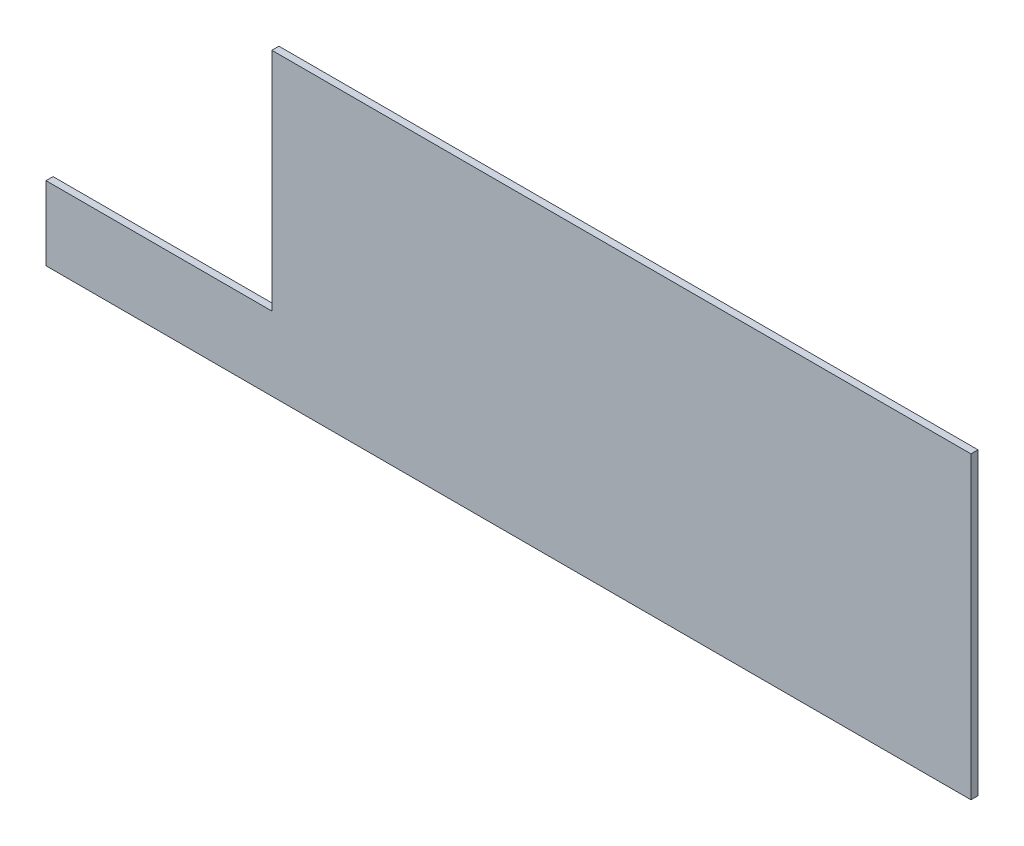
ISO-10303-21;
HEADER;
FILE_DESCRIPTION(('STEP AP214'),'2;1');
FILE_NAME('part.step','',(''),(''),'','','');
FILE_SCHEMA(('AUTOMOTIVE_DESIGN { 1 0 10303 214 1 1 1 1 }'));
ENDSEC;
DATA;
#1=APPLICATION_CONTEXT('core data for automotive mechanical design processes');
#2=APPLICATION_PROTOCOL_DEFINITION('international standard','automotive_design',2000,#1);
#3=PRODUCT_CONTEXT('',#1,'mechanical');
#4=PRODUCT('Part','Part','',(#3));
#5=PRODUCT_RELATED_PRODUCT_CATEGORY('part','',(#4));
#6=PRODUCT_DEFINITION_FORMATION('','',#4);
#7=PRODUCT_DEFINITION_CONTEXT('part definition',#1,'design');
#8=PRODUCT_DEFINITION('design','',#6,#7);
#9=PRODUCT_DEFINITION_SHAPE('','',#8);
#10=(LENGTH_UNIT() NAMED_UNIT(*) SI_UNIT(.MILLI.,.METRE.));
#11=(NAMED_UNIT(*) PLANE_ANGLE_UNIT() SI_UNIT($,.RADIAN.));
#12=(NAMED_UNIT(*) SI_UNIT($,.STERADIAN.) SOLID_ANGLE_UNIT());
#13=UNCERTAINTY_MEASURE_WITH_UNIT(LENGTH_MEASURE(1.E-05),#10,'distance_accuracy_value','');
#14=(GEOMETRIC_REPRESENTATION_CONTEXT(3) GLOBAL_UNCERTAINTY_ASSIGNED_CONTEXT((#13)) GLOBAL_UNIT_ASSIGNED_CONTEXT((#10,
#11,#12)) REPRESENTATION_CONTEXT('',''));
#15=CARTESIAN_POINT('',(0.,0.,0.));
#16=DIRECTION('',(0.,0.,1.));
#17=DIRECTION('',(1.,0.,0.));
#18=AXIS2_PLACEMENT_3D('',#15,#16,#17);
#19=CARTESIAN_POINT('',(-24.0746748096194,111.148523923538,3.175));
#20=DIRECTION('',(0.,-1.,0.));
#21=DIRECTION('',(0.,0.,-1.));
#22=AXIS2_PLACEMENT_3D('',#19,#20,#21);
#23=PLANE('',#22);
#24=DIRECTION('',(-1.,0.,0.));
#25=VECTOR('',#24,1.);
#26=CARTESIAN_POINT('',(-24.0746748096194,111.148523923538,0.));
#27=LINE('',#26,#25);
#28=CARTESIAN_POINT('',(290.405325190381,111.148523923538,0.));
#29=VERTEX_POINT('',#28);
#30=CARTESIAN_POINT('',(-24.0746748096194,111.148523923538,0.));
#31=VERTEX_POINT('',#30);
#32=EDGE_CURVE('E123',#29,#31,#27,.T.);
#33=ORIENTED_EDGE('',*,*,#32,.T.);
#34=DIRECTION('',(0.,0.,-1.));
#35=VECTOR('',#34,1.);
#36=CARTESIAN_POINT('',(-24.0746748096194,111.148523923538,3.175));
#37=LINE('',#36,#35);
#38=CARTESIAN_POINT('',(-24.0746748096194,111.148523923538,3.175));
#39=VERTEX_POINT('',#38);
#40=EDGE_CURVE('E11',#39,#31,#37,.T.);
#41=ORIENTED_EDGE('',*,*,#40,.F.);
#42=DIRECTION('',(-1.,0.,0.));
#43=VECTOR('',#42,1.);
#44=CARTESIAN_POINT('',(-24.0746748096194,111.148523923538,3.175));
#45=LINE('',#44,#43);
#46=CARTESIAN_POINT('',(290.405325190381,111.148523923538,3.175));
#47=VERTEX_POINT('',#46);
#48=EDGE_CURVE('E133',#47,#39,#45,.T.);
#49=ORIENTED_EDGE('',*,*,#48,.F.);
#50=DIRECTION('',(0.,0.,-1.));
#51=VECTOR('',#50,1.);
#52=CARTESIAN_POINT('',(290.405325190381,111.148523923538,3.175));
#53=LINE('',#52,#51);
#54=EDGE_CURVE('E119',#47,#29,#53,.T.);
#55=ORIENTED_EDGE('',*,*,#54,.T.);
#56=EDGE_LOOP('',(#33,#41,#49,#55));
#57=FACE_BOUND('',#56,.T.);
#58=ADVANCED_FACE('F39',(#57),#23,.F.);
#59=CARTESIAN_POINT('',(-24.0746748096194,111.148523923538,3.175));
#60=DIRECTION('',(1.,0.,0.));
#61=DIRECTION('',(0.,1.,0.));
#62=AXIS2_PLACEMENT_3D('',#59,#60,#61);
#63=PLANE('',#62);
#64=DIRECTION('',(0.,-1.,0.));
#65=VECTOR('',#64,1.);
#66=CARTESIAN_POINT('',(-24.0746748096194,111.148523923538,0.));
#67=LINE('',#66,#65);
#68=CARTESIAN_POINT('',(-24.0746748096194,9.54852392353838,0.));
#69=VERTEX_POINT('',#68);
#70=EDGE_CURVE('E126',#31,#69,#67,.T.);
#71=ORIENTED_EDGE('',*,*,#70,.T.);
#72=DIRECTION('',(0.,0.,-1.));
#73=VECTOR('',#72,1.);
#74=CARTESIAN_POINT('',(-24.0746748096194,9.54852392353838,3.175));
#75=LINE('',#74,#73);
#76=CARTESIAN_POINT('',(-24.0746748096194,9.54852392353838,3.175));
#77=VERTEX_POINT('',#76);
#78=EDGE_CURVE('E47',#77,#69,#75,.T.);
#79=ORIENTED_EDGE('',*,*,#78,.F.);
#80=DIRECTION('',(0.,-1.,0.));
#81=VECTOR('',#80,1.);
#82=CARTESIAN_POINT('',(-24.0746748096194,111.148523923538,3.175));
#83=LINE('',#82,#81);
#84=EDGE_CURVE('E92',#39,#77,#83,.T.);
#85=ORIENTED_EDGE('',*,*,#84,.F.);
#86=ORIENTED_EDGE('',*,*,#40,.T.);
#87=EDGE_LOOP('',(#71,#79,#85,#86));
#88=FACE_BOUND('',#87,.T.);
#89=ADVANCED_FACE('F157',(#88),#63,.F.);
#90=CARTESIAN_POINT('',(-24.0746748096194,9.54852392353838,3.175));
#91=DIRECTION('',(0.,-1.,0.));
#92=DIRECTION('',(0.,0.,-1.));
#93=AXIS2_PLACEMENT_3D('',#90,#91,#92);
#94=PLANE('',#93);
#95=DIRECTION('',(-1.,0.,0.));
#96=VECTOR('',#95,1.);
#97=CARTESIAN_POINT('',(-24.0746748096194,9.54852392353838,0.));
#98=LINE('',#97,#96);
#99=CARTESIAN_POINT('',(-125.674674809619,9.54852392353838,0.));
#100=VERTEX_POINT('',#99);
#101=EDGE_CURVE('E128',#69,#100,#98,.T.);
#102=ORIENTED_EDGE('',*,*,#101,.T.);
#103=DIRECTION('',(0.,0.,-1.));
#104=VECTOR('',#103,1.);
#105=CARTESIAN_POINT('',(-125.674674809619,9.54852392353838,3.175));
#106=LINE('',#105,#104);
#107=CARTESIAN_POINT('',(-125.674674809619,9.54852392353838,3.175));
#108=VERTEX_POINT('',#107);
#109=EDGE_CURVE('E114',#108,#100,#106,.T.);
#110=ORIENTED_EDGE('',*,*,#109,.F.);
#111=DIRECTION('',(-1.,0.,0.));
#112=VECTOR('',#111,1.);
#113=CARTESIAN_POINT('',(-24.0746748096194,9.54852392353838,3.175));
#114=LINE('',#113,#112);
#115=EDGE_CURVE('E105',#77,#108,#114,.T.);
#116=ORIENTED_EDGE('',*,*,#115,.F.);
#117=ORIENTED_EDGE('',*,*,#78,.T.);
#118=EDGE_LOOP('',(#102,#110,#116,#117));
#119=FACE_BOUND('',#118,.T.);
#120=ADVANCED_FACE('F139',(#119),#94,.F.);
#121=CARTESIAN_POINT('',(-125.674674809619,9.54852392353838,3.175));
#122=DIRECTION('',(1.,0.,0.));
#123=DIRECTION('',(0.,1.,0.));
#124=AXIS2_PLACEMENT_3D('',#121,#122,#123);
#125=PLANE('',#124);
#126=DIRECTION('',(0.,-1.,0.));
#127=VECTOR('',#126,1.);
#128=CARTESIAN_POINT('',(-125.674674809619,9.54852392353838,0.));
#129=LINE('',#128,#127);
#130=CARTESIAN_POINT('',(-125.674674809619,-23.6264760764616,0.));
#131=VERTEX_POINT('',#130);
#132=EDGE_CURVE('E113',#100,#131,#129,.T.);
#133=ORIENTED_EDGE('',*,*,#132,.T.);
#134=DIRECTION('',(0.,0.,-1.));
#135=VECTOR('',#134,1.);
#136=CARTESIAN_POINT('',(-125.674674809619,-23.6264760764616,3.175));
#137=LINE('',#136,#135);
#138=CARTESIAN_POINT('',(-125.674674809619,-23.6264760764616,3.175));
#139=VERTEX_POINT('',#138);
#140=EDGE_CURVE('E110',#139,#131,#137,.T.);
#141=ORIENTED_EDGE('',*,*,#140,.F.);
#142=DIRECTION('',(0.,-1.,0.));
#143=VECTOR('',#142,1.);
#144=CARTESIAN_POINT('',(-125.674674809619,9.54852392353838,3.175));
#145=LINE('',#144,#143);
#146=EDGE_CURVE('E99',#108,#139,#145,.T.);
#147=ORIENTED_EDGE('',*,*,#146,.F.);
#148=ORIENTED_EDGE('',*,*,#109,.T.);
#149=EDGE_LOOP('',(#133,#141,#147,#148));
#150=FACE_BOUND('',#149,.T.);
#151=ADVANCED_FACE('F111',(#150),#125,.F.);
#152=CARTESIAN_POINT('',(-125.674674809619,-23.6264760764616,3.175));
#153=DIRECTION('',(0.,1.,0.));
#154=DIRECTION('',(-1.,0.,0.));
#155=AXIS2_PLACEMENT_3D('',#152,#153,#154);
#156=PLANE('',#155);
#157=DIRECTION('',(1.,0.,0.));
#158=VECTOR('',#157,1.);
#159=CARTESIAN_POINT('',(-125.674674809619,-23.6264760764616,0.));
#160=LINE('',#159,#158);
#161=CARTESIAN_POINT('',(290.405325190381,-23.6264760764616,0.));
#162=VERTEX_POINT('',#161);
#163=EDGE_CURVE('E78',#131,#162,#160,.T.);
#164=ORIENTED_EDGE('',*,*,#163,.T.);
#165=DIRECTION('',(0.,0.,-1.));
#166=VECTOR('',#165,1.);
#167=CARTESIAN_POINT('',(290.405325190381,-23.6264760764616,3.175));
#168=LINE('',#167,#166);
#169=CARTESIAN_POINT('',(290.405325190381,-23.6264760764616,3.175));
#170=VERTEX_POINT('',#169);
#171=EDGE_CURVE('E115',#170,#162,#168,.T.);
#172=ORIENTED_EDGE('',*,*,#171,.F.);
#173=DIRECTION('',(1.,0.,0.));
#174=VECTOR('',#173,1.);
#175=CARTESIAN_POINT('',(-125.674674809619,-23.6264760764616,3.175));
#176=LINE('',#175,#174);
#177=EDGE_CURVE('E103',#139,#170,#176,.T.);
#178=ORIENTED_EDGE('',*,*,#177,.F.);
#179=ORIENTED_EDGE('',*,*,#140,.T.);
#180=EDGE_LOOP('',(#164,#172,#178,#179));
#181=FACE_BOUND('',#180,.T.);
#182=ADVANCED_FACE('F117',(#181),#156,.F.);
#183=CARTESIAN_POINT('',(290.405325190381,111.148523923538,3.175));
#184=DIRECTION('',(-1.,0.,0.));
#185=DIRECTION('',(0.,0.,1.));
#186=AXIS2_PLACEMENT_3D('',#183,#184,#185);
#187=PLANE('',#186);
#188=DIRECTION('',(0.,1.,0.));
#189=VECTOR('',#188,1.);
#190=CARTESIAN_POINT('',(290.405325190381,111.148523923538,0.));
#191=LINE('',#190,#189);
#192=EDGE_CURVE('E84',#162,#29,#191,.T.);
#193=ORIENTED_EDGE('',*,*,#192,.T.);
#194=ORIENTED_EDGE('',*,*,#54,.F.);
#195=DIRECTION('',(0.,1.,0.));
#196=VECTOR('',#195,1.);
#197=CARTESIAN_POINT('',(290.405325190381,111.148523923538,3.175));
#198=LINE('',#197,#196);
#199=EDGE_CURVE('E55',#170,#47,#198,.T.);
#200=ORIENTED_EDGE('',*,*,#199,.F.);
#201=ORIENTED_EDGE('',*,*,#171,.T.);
#202=EDGE_LOOP('',(#193,#194,#200,#201));
#203=FACE_BOUND('',#202,.T.);
#204=ADVANCED_FACE('F146',(#203),#187,.F.);
#205=CARTESIAN_POINT('',(0.,0.,3.175));
#206=DIRECTION('',(0.,0.,-1.));
#207=DIRECTION('',(-1.,0.,0.));
#208=AXIS2_PLACEMENT_3D('',#205,#206,#207);
#209=PLANE('',#208);
#210=ORIENTED_EDGE('',*,*,#48,.T.);
#211=ORIENTED_EDGE('',*,*,#84,.T.);
#212=ORIENTED_EDGE('',*,*,#115,.T.);
#213=ORIENTED_EDGE('',*,*,#146,.T.);
#214=ORIENTED_EDGE('',*,*,#177,.T.);
#215=ORIENTED_EDGE('',*,*,#199,.T.);
#216=EDGE_LOOP('',(#210,#211,#212,#213,#214,#215));
#217=FACE_BOUND('',#216,.T.);
#218=ADVANCED_FACE('F101',(#217),#209,.F.);
#219=CARTESIAN_POINT('',(0.,0.,0.));
#220=DIRECTION('',(0.,0.,-1.));
#221=DIRECTION('',(-1.,0.,0.));
#222=AXIS2_PLACEMENT_3D('',#219,#220,#221);
#223=PLANE('',#222);
#224=ORIENTED_EDGE('',*,*,#32,.F.);
#225=ORIENTED_EDGE('',*,*,#192,.F.);
#226=ORIENTED_EDGE('',*,*,#163,.F.);
#227=ORIENTED_EDGE('',*,*,#132,.F.);
#228=ORIENTED_EDGE('',*,*,#101,.F.);
#229=ORIENTED_EDGE('',*,*,#70,.F.);
#230=EDGE_LOOP('',(#224,#225,#226,#227,#228,#229));
#231=FACE_BOUND('',#230,.T.);
#232=ADVANCED_FACE('F142',(#231),#223,.T.);
#233=CLOSED_SHELL('',(#58,#89,#120,#151,#182,#204,#218,#232));
#234=MANIFOLD_SOLID_BREP('B2',#233);
#235=ADVANCED_BREP_SHAPE_REPRESENTATION('',(#18,#234),#14);
#236=SHAPE_DEFINITION_REPRESENTATION(#9,#235);
ENDSEC;
END-ISO-10303-21;
